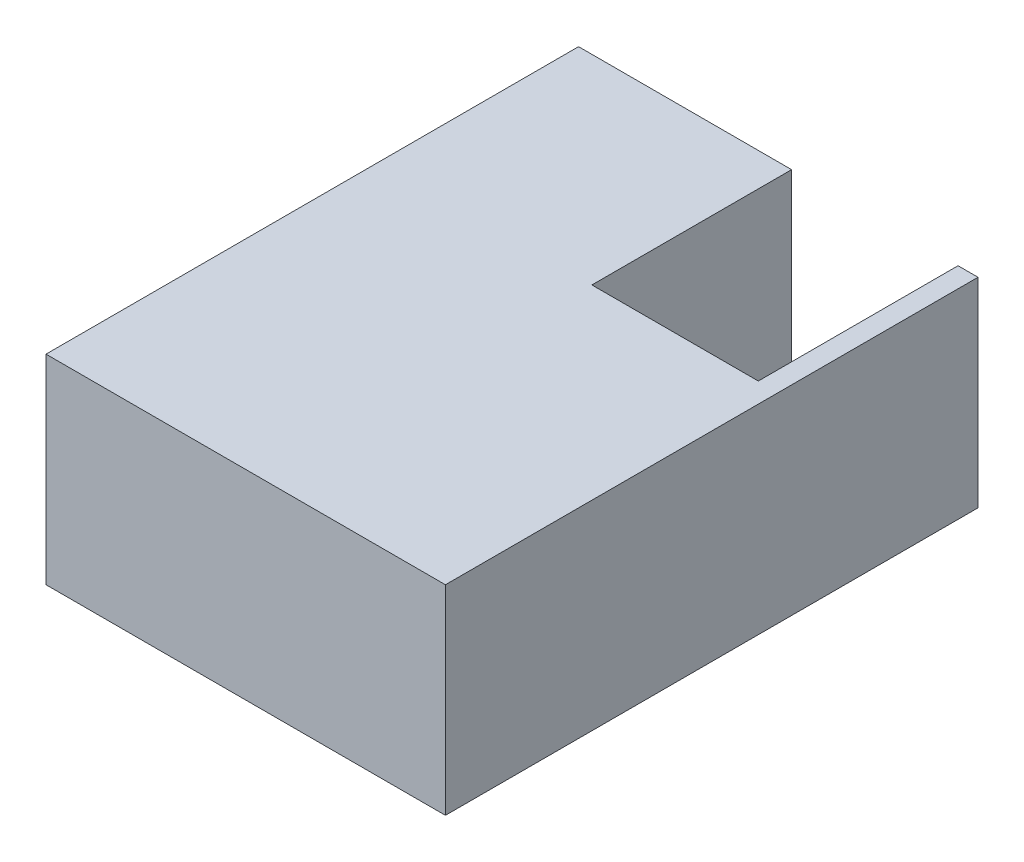
ISO-10303-21;
HEADER;
FILE_DESCRIPTION(('STEP AP214'),'2;1');
FILE_NAME('part.step','',(''),(''),'','','');
FILE_SCHEMA(('AUTOMOTIVE_DESIGN { 1 0 10303 214 1 1 1 1 }'));
ENDSEC;
DATA;
#1=APPLICATION_CONTEXT('core data for automotive mechanical design processes');
#2=APPLICATION_PROTOCOL_DEFINITION('international standard','automotive_design',2000,#1);
#3=PRODUCT_CONTEXT('',#1,'mechanical');
#4=PRODUCT('Part','Part','',(#3));
#5=PRODUCT_RELATED_PRODUCT_CATEGORY('part','',(#4));
#6=PRODUCT_DEFINITION_FORMATION('','',#4);
#7=PRODUCT_DEFINITION_CONTEXT('part definition',#1,'design');
#8=PRODUCT_DEFINITION('design','',#6,#7);
#9=PRODUCT_DEFINITION_SHAPE('','',#8);
#10=(LENGTH_UNIT() NAMED_UNIT(*) SI_UNIT(.MILLI.,.METRE.));
#11=(NAMED_UNIT(*) PLANE_ANGLE_UNIT() SI_UNIT($,.RADIAN.));
#12=(NAMED_UNIT(*) SI_UNIT($,.STERADIAN.) SOLID_ANGLE_UNIT());
#13=UNCERTAINTY_MEASURE_WITH_UNIT(LENGTH_MEASURE(1.E-05),#10,'distance_accuracy_value','');
#14=(GEOMETRIC_REPRESENTATION_CONTEXT(3) GLOBAL_UNCERTAINTY_ASSIGNED_CONTEXT((#13)) GLOBAL_UNIT_ASSIGNED_CONTEXT((#10,
#11,#12)) REPRESENTATION_CONTEXT('',''));
#15=CARTESIAN_POINT('',(0.,0.,0.));
#16=DIRECTION('',(0.,0.,1.));
#17=DIRECTION('',(1.,0.,0.));
#18=AXIS2_PLACEMENT_3D('',#15,#16,#17);
#19=CARTESIAN_POINT('',(0.,300.,0.));
#20=DIRECTION('',(0.,0.,1.));
#21=DIRECTION('',(1.,0.,0.));
#22=AXIS2_PLACEMENT_3D('',#19,#20,#21);
#23=PLANE('',#22);
#24=DIRECTION('',(-1.,0.,0.));
#25=VECTOR('',#24,1.);
#26=CARTESIAN_POINT('',(0.,0.,0.));
#27=LINE('',#26,#25);
#28=CARTESIAN_POINT('',(600.,0.,0.));
#29=VERTEX_POINT('',#28);
#30=CARTESIAN_POINT('',(570.,0.,0.));
#31=VERTEX_POINT('',#30);
#32=EDGE_CURVE('E126',#29,#31,#27,.T.);
#33=ORIENTED_EDGE('',*,*,#32,.T.);
#34=DIRECTION('',(0.,1.,0.));
#35=VECTOR('',#34,1.);
#36=CARTESIAN_POINT('',(570.,0.,0.));
#37=LINE('',#36,#35);
#38=CARTESIAN_POINT('',(570.,300.,0.));
#39=VERTEX_POINT('',#38);
#40=EDGE_CURVE('E110',#31,#39,#37,.T.);
#41=ORIENTED_EDGE('',*,*,#40,.T.);
#42=DIRECTION('',(-1.,0.,0.));
#43=VECTOR('',#42,1.);
#44=CARTESIAN_POINT('',(0.,300.,0.));
#45=LINE('',#44,#43);
#46=CARTESIAN_POINT('',(600.,300.,0.));
#47=VERTEX_POINT('',#46);
#48=EDGE_CURVE('E143',#47,#39,#45,.T.);
#49=ORIENTED_EDGE('',*,*,#48,.F.);
#50=DIRECTION('',(0.,-1.,0.));
#51=VECTOR('',#50,1.);
#52=CARTESIAN_POINT('',(600.,300.,0.));
#53=LINE('',#52,#51);
#54=EDGE_CURVE('E133',#47,#29,#53,.T.);
#55=ORIENTED_EDGE('',*,*,#54,.T.);
#56=EDGE_LOOP('',(#33,#41,#49,#55));
#57=FACE_BOUND('',#56,.T.);
#58=ADVANCED_FACE('F35',(#57),#23,.F.);
#59=CARTESIAN_POINT('',(0.,300.,0.));
#60=DIRECTION('',(1.,0.,0.));
#61=DIRECTION('',(0.,0.,-1.));
#62=AXIS2_PLACEMENT_3D('',#59,#60,#61);
#63=PLANE('',#62);
#64=DIRECTION('',(0.,0.,1.));
#65=VECTOR('',#64,1.);
#66=CARTESIAN_POINT('',(0.,0.,0.));
#67=LINE('',#66,#65);
#68=CARTESIAN_POINT('',(0.,0.,0.));
#69=VERTEX_POINT('',#68);
#70=CARTESIAN_POINT('',(0.,0.,800.));
#71=VERTEX_POINT('',#70);
#72=EDGE_CURVE('E151',#69,#71,#67,.T.);
#73=ORIENTED_EDGE('',*,*,#72,.T.);
#74=DIRECTION('',(0.,-1.,0.));
#75=VECTOR('',#74,1.);
#76=CARTESIAN_POINT('',(0.,300.,800.));
#77=LINE('',#76,#75);
#78=CARTESIAN_POINT('',(0.,300.,800.));
#79=VERTEX_POINT('',#78);
#80=EDGE_CURVE('E11',#79,#71,#77,.T.);
#81=ORIENTED_EDGE('',*,*,#80,.F.);
#82=DIRECTION('',(0.,0.,1.));
#83=VECTOR('',#82,1.);
#84=CARTESIAN_POINT('',(0.,300.,0.));
#85=LINE('',#84,#83);
#86=CARTESIAN_POINT('',(0.,300.,0.));
#87=VERTEX_POINT('',#86);
#88=EDGE_CURVE('E134',#87,#79,#85,.T.);
#89=ORIENTED_EDGE('',*,*,#88,.F.);
#90=DIRECTION('',(0.,-1.,0.));
#91=VECTOR('',#90,1.);
#92=CARTESIAN_POINT('',(0.,300.,0.));
#93=LINE('',#92,#91);
#94=EDGE_CURVE('E141',#87,#69,#93,.T.);
#95=ORIENTED_EDGE('',*,*,#94,.T.);
#96=EDGE_LOOP('',(#73,#81,#89,#95));
#97=FACE_BOUND('',#96,.T.);
#98=ADVANCED_FACE('F37',(#97),#63,.F.);
#99=CARTESIAN_POINT('',(0.,300.,800.));
#100=DIRECTION('',(0.,0.,-1.));
#101=DIRECTION('',(-1.,0.,0.));
#102=AXIS2_PLACEMENT_3D('',#99,#100,#101);
#103=PLANE('',#102);
#104=DIRECTION('',(1.,0.,0.));
#105=VECTOR('',#104,1.);
#106=CARTESIAN_POINT('',(0.,0.,800.));
#107=LINE('',#106,#105);
#108=CARTESIAN_POINT('',(600.,0.,800.));
#109=VERTEX_POINT('',#108);
#110=EDGE_CURVE('E150',#71,#109,#107,.T.);
#111=ORIENTED_EDGE('',*,*,#110,.T.);
#112=DIRECTION('',(0.,-1.,0.));
#113=VECTOR('',#112,1.);
#114=CARTESIAN_POINT('',(600.,300.,800.));
#115=LINE('',#114,#113);
#116=CARTESIAN_POINT('',(600.,300.,800.));
#117=VERTEX_POINT('',#116);
#118=EDGE_CURVE('E43',#117,#109,#115,.T.);
#119=ORIENTED_EDGE('',*,*,#118,.F.);
#120=DIRECTION('',(1.,0.,0.));
#121=VECTOR('',#120,1.);
#122=CARTESIAN_POINT('',(0.,300.,800.));
#123=LINE('',#122,#121);
#124=EDGE_CURVE('E88',#79,#117,#123,.T.);
#125=ORIENTED_EDGE('',*,*,#124,.F.);
#126=ORIENTED_EDGE('',*,*,#80,.T.);
#127=EDGE_LOOP('',(#111,#119,#125,#126));
#128=FACE_BOUND('',#127,.T.);
#129=ADVANCED_FACE('F192',(#128),#103,.F.);
#130=CARTESIAN_POINT('',(600.,300.,0.));
#131=DIRECTION('',(-1.,0.,0.));
#132=DIRECTION('',(0.,0.,1.));
#133=AXIS2_PLACEMENT_3D('',#130,#131,#132);
#134=PLANE('',#133);
#135=DIRECTION('',(0.,0.,-1.));
#136=VECTOR('',#135,1.);
#137=CARTESIAN_POINT('',(600.,0.,0.));
#138=LINE('',#137,#136);
#139=EDGE_CURVE('E137',#109,#29,#138,.T.);
#140=ORIENTED_EDGE('',*,*,#139,.T.);
#141=ORIENTED_EDGE('',*,*,#54,.F.);
#142=DIRECTION('',(0.,0.,-1.));
#143=VECTOR('',#142,1.);
#144=CARTESIAN_POINT('',(600.,300.,0.));
#145=LINE('',#144,#143);
#146=EDGE_CURVE('E148',#117,#47,#145,.T.);
#147=ORIENTED_EDGE('',*,*,#146,.F.);
#148=ORIENTED_EDGE('',*,*,#118,.T.);
#149=EDGE_LOOP('',(#140,#141,#147,#148));
#150=FACE_BOUND('',#149,.T.);
#151=ADVANCED_FACE('F147',(#150),#134,.F.);
#152=CARTESIAN_POINT('',(320.,300.,0.));
#153=VERTEX_POINT('',#152);
#154=EDGE_CURVE('E59',#153,#87,#45,.T.);
#155=ORIENTED_EDGE('',*,*,#154,.F.);
#156=DIRECTION('',(0.,1.,0.));
#157=VECTOR('',#156,1.);
#158=CARTESIAN_POINT('',(320.,0.,0.));
#159=LINE('',#158,#157);
#160=CARTESIAN_POINT('',(320.,0.,0.));
#161=VERTEX_POINT('',#160);
#162=EDGE_CURVE('E120',#161,#153,#159,.T.);
#163=ORIENTED_EDGE('',*,*,#162,.F.);
#164=EDGE_CURVE('E81',#161,#69,#27,.T.);
#165=ORIENTED_EDGE('',*,*,#164,.T.);
#166=ORIENTED_EDGE('',*,*,#94,.F.);
#167=EDGE_LOOP('',(#155,#163,#165,#166));
#168=FACE_BOUND('',#167,.T.);
#169=ADVANCED_FACE('F172',(#168),#23,.F.);
#170=CARTESIAN_POINT('',(0.,300.,0.));
#171=DIRECTION('',(0.,1.,0.));
#172=DIRECTION('',(0.,0.,1.));
#173=AXIS2_PLACEMENT_3D('',#170,#171,#172);
#174=PLANE('',#173);
#175=DIRECTION('',(0.,0.,-1.));
#176=VECTOR('',#175,1.);
#177=CARTESIAN_POINT('',(570.,300.,0.));
#178=LINE('',#177,#176);
#179=CARTESIAN_POINT('',(570.,300.,300.));
#180=VERTEX_POINT('',#179);
#181=EDGE_CURVE('E115',#180,#39,#178,.T.);
#182=ORIENTED_EDGE('',*,*,#181,.F.);
#183=DIRECTION('',(1.,0.,0.));
#184=VECTOR('',#183,1.);
#185=CARTESIAN_POINT('',(570.,300.,300.));
#186=LINE('',#185,#184);
#187=CARTESIAN_POINT('',(320.,300.,300.));
#188=VERTEX_POINT('',#187);
#189=EDGE_CURVE('E129',#188,#180,#186,.T.);
#190=ORIENTED_EDGE('',*,*,#189,.F.);
#191=DIRECTION('',(0.,0.,1.));
#192=VECTOR('',#191,1.);
#193=CARTESIAN_POINT('',(320.,300.,0.));
#194=LINE('',#193,#192);
#195=EDGE_CURVE('E165',#153,#188,#194,.T.);
#196=ORIENTED_EDGE('',*,*,#195,.F.);
#197=ORIENTED_EDGE('',*,*,#154,.T.);
#198=ORIENTED_EDGE('',*,*,#88,.T.);
#199=ORIENTED_EDGE('',*,*,#124,.T.);
#200=ORIENTED_EDGE('',*,*,#146,.T.);
#201=ORIENTED_EDGE('',*,*,#48,.T.);
#202=EDGE_LOOP('',(#182,#190,#196,#197,#198,#199,#200,#201));
#203=FACE_BOUND('',#202,.T.);
#204=ADVANCED_FACE('F176',(#203),#174,.T.);
#205=CARTESIAN_POINT('',(0.,0.,0.));
#206=DIRECTION('',(0.,1.,0.));
#207=DIRECTION('',(0.,0.,1.));
#208=AXIS2_PLACEMENT_3D('',#205,#206,#207);
#209=PLANE('',#208);
#210=DIRECTION('',(1.,0.,0.));
#211=VECTOR('',#210,1.);
#212=CARTESIAN_POINT('',(570.,0.,300.));
#213=LINE('',#212,#211);
#214=CARTESIAN_POINT('',(320.,0.,300.));
#215=VERTEX_POINT('',#214);
#216=CARTESIAN_POINT('',(570.,0.,300.));
#217=VERTEX_POINT('',#216);
#218=EDGE_CURVE('E50',#215,#217,#213,.T.);
#219=ORIENTED_EDGE('',*,*,#218,.T.);
#220=DIRECTION('',(0.,0.,-1.));
#221=VECTOR('',#220,1.);
#222=CARTESIAN_POINT('',(570.,0.,0.));
#223=LINE('',#222,#221);
#224=EDGE_CURVE('E113',#217,#31,#223,.T.);
#225=ORIENTED_EDGE('',*,*,#224,.T.);
#226=ORIENTED_EDGE('',*,*,#32,.F.);
#227=ORIENTED_EDGE('',*,*,#139,.F.);
#228=ORIENTED_EDGE('',*,*,#110,.F.);
#229=ORIENTED_EDGE('',*,*,#72,.F.);
#230=ORIENTED_EDGE('',*,*,#164,.F.);
#231=DIRECTION('',(0.,0.,1.));
#232=VECTOR('',#231,1.);
#233=CARTESIAN_POINT('',(320.,0.,0.));
#234=LINE('',#233,#232);
#235=EDGE_CURVE('E128',#161,#215,#234,.T.);
#236=ORIENTED_EDGE('',*,*,#235,.T.);
#237=EDGE_LOOP('',(#219,#225,#226,#227,#228,#229,#230,#236));
#238=FACE_BOUND('',#237,.T.);
#239=ADVANCED_FACE('F124',(#238),#209,.F.);
#240=CARTESIAN_POINT('',(570.,0.,0.));
#241=DIRECTION('',(1.,0.,0.));
#242=DIRECTION('',(0.,0.,-1.));
#243=AXIS2_PLACEMENT_3D('',#240,#241,#242);
#244=PLANE('',#243);
#245=ORIENTED_EDGE('',*,*,#181,.T.);
#246=ORIENTED_EDGE('',*,*,#40,.F.);
#247=ORIENTED_EDGE('',*,*,#224,.F.);
#248=DIRECTION('',(0.,1.,0.));
#249=VECTOR('',#248,1.);
#250=CARTESIAN_POINT('',(570.,0.,300.));
#251=LINE('',#250,#249);
#252=EDGE_CURVE('E153',#217,#180,#251,.T.);
#253=ORIENTED_EDGE('',*,*,#252,.T.);
#254=EDGE_LOOP('',(#245,#246,#247,#253));
#255=FACE_BOUND('',#254,.T.);
#256=ADVANCED_FACE('F112',(#255),#244,.F.);
#257=CARTESIAN_POINT('',(570.,0.,300.));
#258=DIRECTION('',(0.,0.,1.));
#259=DIRECTION('',(1.,0.,0.));
#260=AXIS2_PLACEMENT_3D('',#257,#258,#259);
#261=PLANE('',#260);
#262=ORIENTED_EDGE('',*,*,#189,.T.);
#263=ORIENTED_EDGE('',*,*,#252,.F.);
#264=ORIENTED_EDGE('',*,*,#218,.F.);
#265=DIRECTION('',(0.,1.,0.));
#266=VECTOR('',#265,1.);
#267=CARTESIAN_POINT('',(320.,0.,300.));
#268=LINE('',#267,#266);
#269=EDGE_CURVE('E160',#215,#188,#268,.T.);
#270=ORIENTED_EDGE('',*,*,#269,.T.);
#271=EDGE_LOOP('',(#262,#263,#264,#270));
#272=FACE_BOUND('',#271,.T.);
#273=ADVANCED_FACE('F178',(#272),#261,.F.);
#274=CARTESIAN_POINT('',(320.,0.,0.));
#275=DIRECTION('',(-1.,0.,0.));
#276=DIRECTION('',(0.,0.,1.));
#277=AXIS2_PLACEMENT_3D('',#274,#275,#276);
#278=PLANE('',#277);
#279=ORIENTED_EDGE('',*,*,#195,.T.);
#280=ORIENTED_EDGE('',*,*,#269,.F.);
#281=ORIENTED_EDGE('',*,*,#235,.F.);
#282=ORIENTED_EDGE('',*,*,#162,.T.);
#283=EDGE_LOOP('',(#279,#280,#281,#282));
#284=FACE_BOUND('',#283,.T.);
#285=ADVANCED_FACE('F171',(#284),#278,.F.);
#286=CLOSED_SHELL('',(#58,#98,#129,#151,#169,#204,#239,#256,#273,#285));
#287=MANIFOLD_SOLID_BREP('B2',#286);
#288=ADVANCED_BREP_SHAPE_REPRESENTATION('',(#18,#287),#14);
#289=SHAPE_DEFINITION_REPRESENTATION(#9,#288);
ENDSEC;
END-ISO-10303-21;
